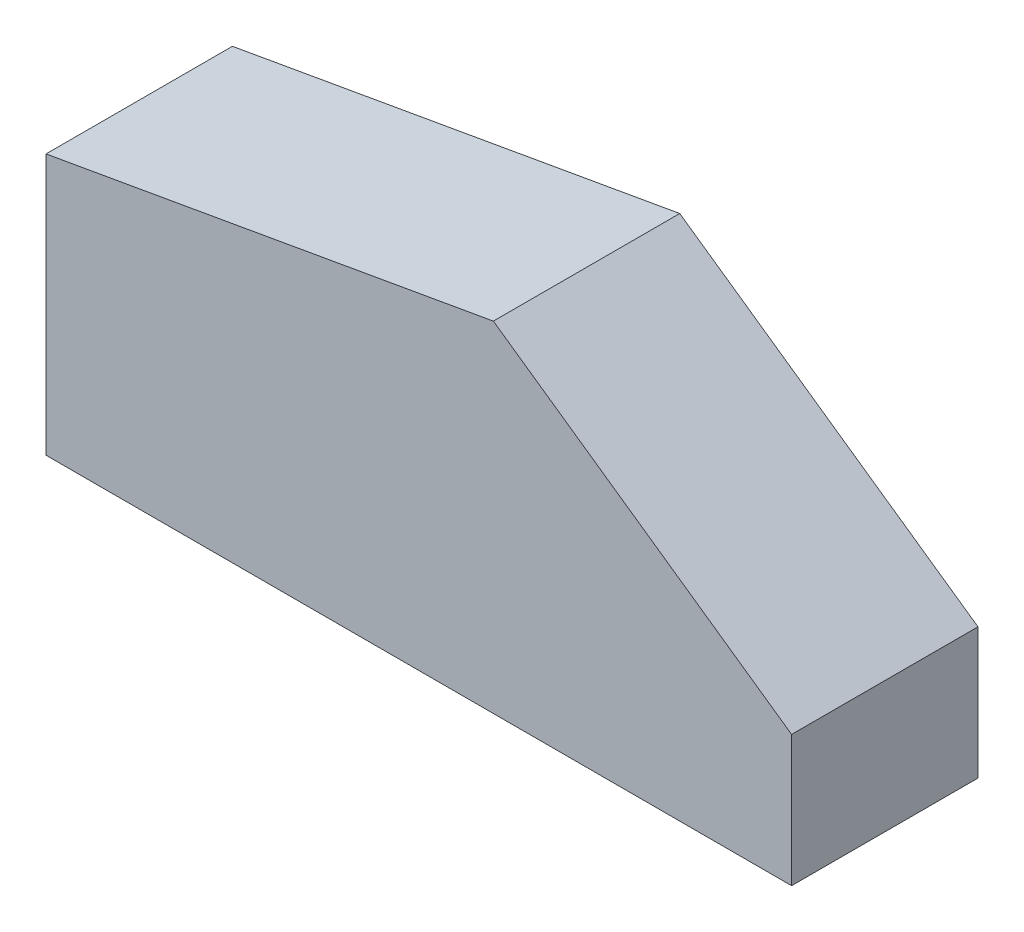
ISO-10303-21;
HEADER;
FILE_DESCRIPTION(('STEP AP214'),'2;1');
FILE_NAME('part.step','',(''),(''),'','','');
FILE_SCHEMA(('AUTOMOTIVE_DESIGN { 1 0 10303 214 1 1 1 1 }'));
ENDSEC;
DATA;
#1=APPLICATION_CONTEXT('core data for automotive mechanical design processes');
#2=APPLICATION_PROTOCOL_DEFINITION('international standard','automotive_design',2000,#1);
#3=PRODUCT_CONTEXT('',#1,'mechanical');
#4=PRODUCT('Part','Part','',(#3));
#5=PRODUCT_RELATED_PRODUCT_CATEGORY('part','',(#4));
#6=PRODUCT_DEFINITION_FORMATION('','',#4);
#7=PRODUCT_DEFINITION_CONTEXT('part definition',#1,'design');
#8=PRODUCT_DEFINITION('design','',#6,#7);
#9=PRODUCT_DEFINITION_SHAPE('','',#8);
#10=(LENGTH_UNIT() NAMED_UNIT(*) SI_UNIT(.MILLI.,.METRE.));
#11=(NAMED_UNIT(*) PLANE_ANGLE_UNIT() SI_UNIT($,.RADIAN.));
#12=(NAMED_UNIT(*) SI_UNIT($,.STERADIAN.) SOLID_ANGLE_UNIT());
#13=UNCERTAINTY_MEASURE_WITH_UNIT(LENGTH_MEASURE(1.E-05),#10,'distance_accuracy_value','');
#14=(GEOMETRIC_REPRESENTATION_CONTEXT(3) GLOBAL_UNCERTAINTY_ASSIGNED_CONTEXT((#13)) GLOBAL_UNIT_ASSIGNED_CONTEXT((#10,
#11,#12)) REPRESENTATION_CONTEXT('',''));
#15=CARTESIAN_POINT('',(0.,0.,0.));
#16=DIRECTION('',(0.,0.,1.));
#17=DIRECTION('',(1.,0.,0.));
#18=AXIS2_PLACEMENT_3D('',#15,#16,#17);
#19=CARTESIAN_POINT('',(100.,0.,25.));
#20=DIRECTION('',(0.,1.,0.));
#21=DIRECTION('',(-1.,0.,0.));
#22=AXIS2_PLACEMENT_3D('',#19,#20,#21);
#23=PLANE('',#22);
#24=DIRECTION('',(1.,0.,0.));
#25=VECTOR('',#24,1.);
#26=CARTESIAN_POINT('',(100.,0.,0.));
#27=LINE('',#26,#25);
#28=CARTESIAN_POINT('',(0.,0.,0.));
#29=VERTEX_POINT('',#28);
#30=CARTESIAN_POINT('',(100.,0.,0.));
#31=VERTEX_POINT('',#30);
#32=EDGE_CURVE('E107',#29,#31,#27,.T.);
#33=ORIENTED_EDGE('',*,*,#32,.T.);
#34=DIRECTION('',(0.,0.,-1.));
#35=VECTOR('',#34,1.);
#36=CARTESIAN_POINT('',(100.,0.,25.));
#37=LINE('',#36,#35);
#38=CARTESIAN_POINT('',(100.,0.,25.));
#39=VERTEX_POINT('',#38);
#40=EDGE_CURVE('E11',#39,#31,#37,.T.);
#41=ORIENTED_EDGE('',*,*,#40,.F.);
#42=DIRECTION('',(1.,0.,0.));
#43=VECTOR('',#42,1.);
#44=CARTESIAN_POINT('',(100.,0.,25.));
#45=LINE('',#44,#43);
#46=CARTESIAN_POINT('',(0.,0.,25.));
#47=VERTEX_POINT('',#46);
#48=EDGE_CURVE('E115',#47,#39,#45,.T.);
#49=ORIENTED_EDGE('',*,*,#48,.F.);
#50=DIRECTION('',(0.,0.,-1.));
#51=VECTOR('',#50,1.);
#52=CARTESIAN_POINT('',(0.,0.,25.));
#53=LINE('',#52,#51);
#54=EDGE_CURVE('E103',#47,#29,#53,.T.);
#55=ORIENTED_EDGE('',*,*,#54,.T.);
#56=EDGE_LOOP('',(#33,#41,#49,#55));
#57=FACE_BOUND('',#56,.T.);
#58=ADVANCED_FACE('F33',(#57),#23,.F.);
#59=CARTESIAN_POINT('',(100.,17.571317314119,25.));
#60=DIRECTION('',(-1.,0.,0.));
#61=DIRECTION('',(0.,0.,1.));
#62=AXIS2_PLACEMENT_3D('',#59,#60,#61);
#63=PLANE('',#62);
#64=DIRECTION('',(0.,1.,0.));
#65=VECTOR('',#64,1.);
#66=CARTESIAN_POINT('',(100.,17.571317314119,0.));
#67=LINE('',#66,#65);
#68=CARTESIAN_POINT('',(100.,17.571317314119,0.));
#69=VERTEX_POINT('',#68);
#70=EDGE_CURVE('E110',#31,#69,#67,.T.);
#71=ORIENTED_EDGE('',*,*,#70,.T.);
#72=DIRECTION('',(0.,0.,-1.));
#73=VECTOR('',#72,1.);
#74=CARTESIAN_POINT('',(100.,17.571317314119,25.));
#75=LINE('',#74,#73);
#76=CARTESIAN_POINT('',(100.,17.571317314119,25.));
#77=VERTEX_POINT('',#76);
#78=EDGE_CURVE('E41',#77,#69,#75,.T.);
#79=ORIENTED_EDGE('',*,*,#78,.F.);
#80=DIRECTION('',(0.,1.,0.));
#81=VECTOR('',#80,1.);
#82=CARTESIAN_POINT('',(100.,17.571317314119,25.));
#83=LINE('',#82,#81);
#84=EDGE_CURVE('E83',#39,#77,#83,.T.);
#85=ORIENTED_EDGE('',*,*,#84,.F.);
#86=ORIENTED_EDGE('',*,*,#40,.T.);
#87=EDGE_LOOP('',(#71,#79,#85,#86));
#88=FACE_BOUND('',#87,.T.);
#89=ADVANCED_FACE('F134',(#88),#63,.F.);
#90=CARTESIAN_POINT('',(60.,45.5796188425077,25.));
#91=DIRECTION('',(-0.57357643635105,-0.819152044288989,0.));
#92=DIRECTION('',(0.819152044288989,-0.57357643635105,0.));
#93=AXIS2_PLACEMENT_3D('',#90,#91,#92);
#94=PLANE('',#93);
#95=DIRECTION('',(-0.819152044288989,0.57357643635105,0.));
#96=VECTOR('',#95,1.);
#97=CARTESIAN_POINT('',(60.,45.5796188425077,0.));
#98=LINE('',#97,#96);
#99=CARTESIAN_POINT('',(60.,45.5796188425077,0.));
#100=VERTEX_POINT('',#99);
#101=EDGE_CURVE('E98',#69,#100,#98,.T.);
#102=ORIENTED_EDGE('',*,*,#101,.T.);
#103=DIRECTION('',(0.,0.,-1.));
#104=VECTOR('',#103,1.);
#105=CARTESIAN_POINT('',(60.,45.5796188425077,25.));
#106=LINE('',#105,#104);
#107=CARTESIAN_POINT('',(60.,45.5796188425077,25.));
#108=VERTEX_POINT('',#107);
#109=EDGE_CURVE('E95',#108,#100,#106,.T.);
#110=ORIENTED_EDGE('',*,*,#109,.F.);
#111=DIRECTION('',(-0.819152044288989,0.57357643635105,0.));
#112=VECTOR('',#111,1.);
#113=CARTESIAN_POINT('',(60.,45.5796188425077,25.));
#114=LINE('',#113,#112);
#115=EDGE_CURVE('E87',#77,#108,#114,.T.);
#116=ORIENTED_EDGE('',*,*,#115,.F.);
#117=ORIENTED_EDGE('',*,*,#78,.T.);
#118=EDGE_LOOP('',(#102,#110,#116,#117));
#119=FACE_BOUND('',#118,.T.);
#120=ADVANCED_FACE('F96',(#119),#94,.F.);
#121=CARTESIAN_POINT('',(0.,35.,25.));
#122=DIRECTION('',(0.173648177666927,-0.984807753012209,0.));
#123=DIRECTION('',(0.984807753012209,0.173648177666927,0.));
#124=AXIS2_PLACEMENT_3D('',#121,#122,#123);
#125=PLANE('',#124);
#126=DIRECTION('',(-0.984807753012209,-0.173648177666927,0.));
#127=VECTOR('',#126,1.);
#128=CARTESIAN_POINT('',(0.,35.,0.));
#129=LINE('',#128,#127);
#130=CARTESIAN_POINT('',(0.,35.,0.));
#131=VERTEX_POINT('',#130);
#132=EDGE_CURVE('E69',#100,#131,#129,.T.);
#133=ORIENTED_EDGE('',*,*,#132,.T.);
#134=DIRECTION('',(0.,0.,-1.));
#135=VECTOR('',#134,1.);
#136=CARTESIAN_POINT('',(0.,35.,25.));
#137=LINE('',#136,#135);
#138=CARTESIAN_POINT('',(0.,35.,25.));
#139=VERTEX_POINT('',#138);
#140=EDGE_CURVE('E99',#139,#131,#137,.T.);
#141=ORIENTED_EDGE('',*,*,#140,.F.);
#142=DIRECTION('',(-0.984807753012209,-0.173648177666927,0.));
#143=VECTOR('',#142,1.);
#144=CARTESIAN_POINT('',(0.,35.,25.));
#145=LINE('',#144,#143);
#146=EDGE_CURVE('E91',#108,#139,#145,.T.);
#147=ORIENTED_EDGE('',*,*,#146,.F.);
#148=ORIENTED_EDGE('',*,*,#109,.T.);
#149=EDGE_LOOP('',(#133,#141,#147,#148));
#150=FACE_BOUND('',#149,.T.);
#151=ADVANCED_FACE('F101',(#150),#125,.F.);
#152=CARTESIAN_POINT('',(0.,0.,25.));
#153=DIRECTION('',(1.,0.,0.));
#154=DIRECTION('',(0.,0.,-1.));
#155=AXIS2_PLACEMENT_3D('',#152,#153,#154);
#156=PLANE('',#155);
#157=DIRECTION('',(0.,-1.,0.));
#158=VECTOR('',#157,1.);
#159=CARTESIAN_POINT('',(0.,0.,0.));
#160=LINE('',#159,#158);
#161=EDGE_CURVE('E75',#131,#29,#160,.T.);
#162=ORIENTED_EDGE('',*,*,#161,.T.);
#163=ORIENTED_EDGE('',*,*,#54,.F.);
#164=DIRECTION('',(0.,-1.,0.));
#165=VECTOR('',#164,1.);
#166=CARTESIAN_POINT('',(0.,0.,25.));
#167=LINE('',#166,#165);
#168=EDGE_CURVE('E49',#139,#47,#167,.T.);
#169=ORIENTED_EDGE('',*,*,#168,.F.);
#170=ORIENTED_EDGE('',*,*,#140,.T.);
#171=EDGE_LOOP('',(#162,#163,#169,#170));
#172=FACE_BOUND('',#171,.T.);
#173=ADVANCED_FACE('F123',(#172),#156,.F.);
#174=CARTESIAN_POINT('',(0.,0.,25.));
#175=DIRECTION('',(0.,0.,-1.));
#176=DIRECTION('',(-1.,0.,0.));
#177=AXIS2_PLACEMENT_3D('',#174,#175,#176);
#178=PLANE('',#177);
#179=ORIENTED_EDGE('',*,*,#48,.T.);
#180=ORIENTED_EDGE('',*,*,#84,.T.);
#181=ORIENTED_EDGE('',*,*,#115,.T.);
#182=ORIENTED_EDGE('',*,*,#146,.T.);
#183=ORIENTED_EDGE('',*,*,#168,.T.);
#184=EDGE_LOOP('',(#179,#180,#181,#182,#183));
#185=FACE_BOUND('',#184,.T.);
#186=ADVANCED_FACE('F89',(#185),#178,.F.);
#187=CARTESIAN_POINT('',(0.,0.,0.));
#188=DIRECTION('',(0.,0.,-1.));
#189=DIRECTION('',(-1.,0.,0.));
#190=AXIS2_PLACEMENT_3D('',#187,#188,#189);
#191=PLANE('',#190);
#192=ORIENTED_EDGE('',*,*,#32,.F.);
#193=ORIENTED_EDGE('',*,*,#161,.F.);
#194=ORIENTED_EDGE('',*,*,#132,.F.);
#195=ORIENTED_EDGE('',*,*,#101,.F.);
#196=ORIENTED_EDGE('',*,*,#70,.F.);
#197=EDGE_LOOP('',(#192,#193,#194,#195,#196));
#198=FACE_BOUND('',#197,.T.);
#199=ADVANCED_FACE('F119',(#198),#191,.T.);
#200=CLOSED_SHELL('',(#58,#89,#120,#151,#173,#186,#199));
#201=MANIFOLD_SOLID_BREP('B2',#200);
#202=ADVANCED_BREP_SHAPE_REPRESENTATION('',(#18,#201),#14);
#203=SHAPE_DEFINITION_REPRESENTATION(#9,#202);
ENDSEC;
END-ISO-10303-21;
